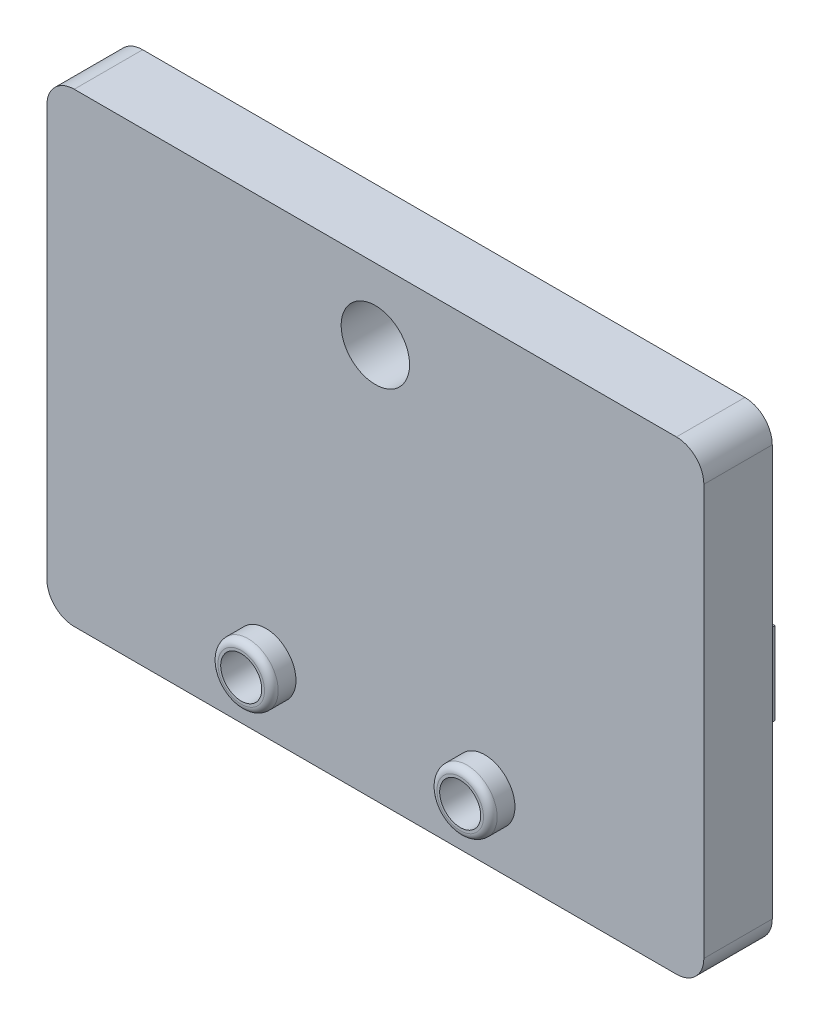
ISO-10303-21;
HEADER;
FILE_DESCRIPTION(('STEP AP214'),'2;1');
FILE_NAME('part.step','',(''),(''),'','','');
FILE_SCHEMA(('AUTOMOTIVE_DESIGN { 1 0 10303 214 1 1 1 1 }'));
ENDSEC;
DATA;
#1=APPLICATION_CONTEXT('core data for automotive mechanical design processes');
#2=APPLICATION_PROTOCOL_DEFINITION('international standard','automotive_design',2000,#1);
#3=PRODUCT_CONTEXT('',#1,'mechanical');
#4=PRODUCT('Part','Part','',(#3));
#5=PRODUCT_RELATED_PRODUCT_CATEGORY('part','',(#4));
#6=PRODUCT_DEFINITION_FORMATION('','',#4);
#7=PRODUCT_DEFINITION_CONTEXT('part definition',#1,'design');
#8=PRODUCT_DEFINITION('design','',#6,#7);
#9=PRODUCT_DEFINITION_SHAPE('','',#8);
#10=(LENGTH_UNIT() NAMED_UNIT(*) SI_UNIT(.MILLI.,.METRE.));
#11=(NAMED_UNIT(*) PLANE_ANGLE_UNIT() SI_UNIT($,.RADIAN.));
#12=(NAMED_UNIT(*) SI_UNIT($,.STERADIAN.) SOLID_ANGLE_UNIT());
#13=UNCERTAINTY_MEASURE_WITH_UNIT(LENGTH_MEASURE(1.E-05),#10,'distance_accuracy_value','');
#14=(GEOMETRIC_REPRESENTATION_CONTEXT(3) GLOBAL_UNCERTAINTY_ASSIGNED_CONTEXT((#13)) GLOBAL_UNIT_ASSIGNED_CONTEXT((#10,
#11,#12)) REPRESENTATION_CONTEXT('',''));
#15=CARTESIAN_POINT('',(0.,0.,0.));
#16=DIRECTION('',(0.,0.,1.));
#17=DIRECTION('',(1.,0.,0.));
#18=AXIS2_PLACEMENT_3D('',#15,#16,#17);
#19=CARTESIAN_POINT('',(10.4595722027057,87.8035788721695,0.));
#20=DIRECTION('',(0.,0.,1.));
#21=DIRECTION('',(1.,0.,0.));
#22=AXIS2_PLACEMENT_3D('',#19,#20,#21);
#23=PLANE('',#22);
#24=DIRECTION('',(0.,-1.,0.));
#25=VECTOR('',#24,1.);
#26=CARTESIAN_POINT('',(7.66930854298196,95.468963941608,0.));
#27=LINE('',#26,#25);
#28=CARTESIAN_POINT('',(7.66930854298196,101.468963941608,0.));
#29=VERTEX_POINT('',#28);
#30=CARTESIAN_POINT('',(7.66930854298196,95.468963941608,0.));
#31=VERTEX_POINT('',#30);
#32=EDGE_CURVE('E172',#29,#31,#27,.T.);
#33=ORIENTED_EDGE('',*,*,#32,.F.);
#34=DIRECTION('',(1.,0.,0.));
#35=VECTOR('',#34,1.);
#36=CARTESIAN_POINT('',(1.66930854298196,101.468963941608,0.));
#37=LINE('',#36,#35);
#38=CARTESIAN_POINT('',(1.66930854298196,101.468963941608,0.));
#39=VERTEX_POINT('',#38);
#40=EDGE_CURVE('E185',#39,#29,#37,.T.);
#41=ORIENTED_EDGE('',*,*,#40,.F.);
#42=DIRECTION('',(0.,1.,0.));
#43=VECTOR('',#42,1.);
#44=CARTESIAN_POINT('',(1.66930854298196,95.468963941608,0.));
#45=LINE('',#44,#43);
#46=CARTESIAN_POINT('',(1.66930854298196,95.468963941608,0.));
#47=VERTEX_POINT('',#46);
#48=EDGE_CURVE('E194',#47,#39,#45,.T.);
#49=ORIENTED_EDGE('',*,*,#48,.F.);
#50=DIRECTION('',(-1.,0.,0.));
#51=VECTOR('',#50,1.);
#52=CARTESIAN_POINT('',(1.66930854298196,95.468963941608,0.));
#53=LINE('',#52,#51);
#54=EDGE_CURVE('E175',#31,#47,#53,.T.);
#55=ORIENTED_EDGE('',*,*,#54,.F.);
#56=EDGE_LOOP('',(#33,#41,#49,#55));
#57=FACE_BOUND('',#56,.T.);
#58=CARTESIAN_POINT('',(-11.5404277972943,114.618963941608,0.));
#59=DIRECTION('',(0.,0.,-1.));
#60=DIRECTION('',(-1.,0.,0.));
#61=AXIS2_PLACEMENT_3D('',#58,#59,#60);
#62=CIRCLE('',#61,2.5);
#63=CARTESIAN_POINT('',(-14.0404277972943,114.618963941608,0.));
#64=VERTEX_POINT('',#63);
#65=EDGE_CURVE('E210',#64,#64,#62,.T.);
#66=ORIENTED_EDGE('',*,*,#65,.F.);
#67=EDGE_LOOP('',(#66));
#68=FACE_BOUND('',#67,.T.);
#69=CARTESIAN_POINT('',(-3.54042779729434,90.4912898586758,0.));
#70=DIRECTION('',(0.,0.,1.));
#71=DIRECTION('',(1.,0.,0.));
#72=AXIS2_PLACEMENT_3D('',#69,#70,#71);
#73=CIRCLE('',#72,1.5);
#74=CARTESIAN_POINT('',(-2.04042779729434,90.4912898586758,0.));
#75=VERTEX_POINT('',#74);
#76=EDGE_CURVE('E217',#75,#75,#73,.T.);
#77=ORIENTED_EDGE('',*,*,#76,.T.);
#78=EDGE_LOOP('',(#77));
#79=FACE_BOUND('',#78,.T.);
#80=CARTESIAN_POINT('',(-19.5404277972943,90.4912898586758,0.));
#81=DIRECTION('',(0.,0.,1.));
#82=DIRECTION('',(1.,0.,0.));
#83=AXIS2_PLACEMENT_3D('',#80,#81,#82);
#84=CIRCLE('',#83,1.5);
#85=CARTESIAN_POINT('',(-18.0404277972943,90.4912898586758,0.));
#86=VERTEX_POINT('',#85);
#87=EDGE_CURVE('E216',#86,#86,#84,.T.);
#88=ORIENTED_EDGE('',*,*,#87,.T.);
#89=EDGE_LOOP('',(#88));
#90=FACE_BOUND('',#89,.T.);
#91=CARTESIAN_POINT('',(10.4595722027057,87.8035788721695,0.));
#92=DIRECTION('',(0.,0.,1.));
#93=DIRECTION('',(1.,0.,0.));
#94=AXIS2_PLACEMENT_3D('',#91,#92,#93);
#95=CIRCLE('',#94,2.);
#96=CARTESIAN_POINT('',(10.4595722027057,85.8035788721695,0.));
#97=VERTEX_POINT('',#96);
#98=CARTESIAN_POINT('',(12.4595722027057,87.8035788721695,0.));
#99=VERTEX_POINT('',#98);
#100=EDGE_CURVE('E233',#97,#99,#95,.T.);
#101=ORIENTED_EDGE('',*,*,#100,.F.);
#102=DIRECTION('',(1.,0.,0.));
#103=VECTOR('',#102,1.);
#104=CARTESIAN_POINT('',(-33.5404277972944,85.8035788721695,0.));
#105=LINE('',#104,#103);
#106=CARTESIAN_POINT('',(-33.5404277972944,85.8035788721695,0.));
#107=VERTEX_POINT('',#106);
#108=EDGE_CURVE('E241',#107,#97,#105,.T.);
#109=ORIENTED_EDGE('',*,*,#108,.F.);
#110=CARTESIAN_POINT('',(-33.5404277972944,87.8035788721695,0.));
#111=DIRECTION('',(0.,0.,1.));
#112=DIRECTION('',(1.,0.,0.));
#113=AXIS2_PLACEMENT_3D('',#110,#111,#112);
#114=CIRCLE('',#113,2.);
#115=CARTESIAN_POINT('',(-35.5404277972944,87.8035788721695,0.));
#116=VERTEX_POINT('',#115);
#117=EDGE_CURVE('E268',#116,#107,#114,.T.);
#118=ORIENTED_EDGE('',*,*,#117,.F.);
#119=DIRECTION('',(0.,-1.,0.));
#120=VECTOR('',#119,1.);
#121=CARTESIAN_POINT('',(-35.5404277972944,117.80357887217,0.));
#122=LINE('',#121,#120);
#123=CARTESIAN_POINT('',(-35.5404277972944,117.80357887217,0.));
#124=VERTEX_POINT('',#123);
#125=EDGE_CURVE('E266',#124,#116,#122,.T.);
#126=ORIENTED_EDGE('',*,*,#125,.F.);
#127=CARTESIAN_POINT('',(-33.5404277972944,117.80357887217,0.));
#128=DIRECTION('',(0.,0.,1.));
#129=DIRECTION('',(1.,0.,0.));
#130=AXIS2_PLACEMENT_3D('',#127,#128,#129);
#131=CIRCLE('',#130,2.);
#132=CARTESIAN_POINT('',(-33.5404277972943,119.80357887217,0.));
#133=VERTEX_POINT('',#132);
#134=EDGE_CURVE('E264',#133,#124,#131,.T.);
#135=ORIENTED_EDGE('',*,*,#134,.F.);
#136=DIRECTION('',(-1.,0.,0.));
#137=VECTOR('',#136,1.);
#138=CARTESIAN_POINT('',(-33.5404277972943,119.80357887217,0.));
#139=LINE('',#138,#137);
#140=CARTESIAN_POINT('',(10.4595722027056,119.80357887217,0.));
#141=VERTEX_POINT('',#140);
#142=EDGE_CURVE('E262',#141,#133,#139,.T.);
#143=ORIENTED_EDGE('',*,*,#142,.F.);
#144=CARTESIAN_POINT('',(10.4595722027057,117.80357887217,0.));
#145=DIRECTION('',(0.,0.,1.));
#146=DIRECTION('',(-1.,0.,0.));
#147=AXIS2_PLACEMENT_3D('',#144,#145,#146);
#148=CIRCLE('',#147,2.);
#149=CARTESIAN_POINT('',(12.4595722027057,117.80357887217,0.));
#150=VERTEX_POINT('',#149);
#151=EDGE_CURVE('E260',#150,#141,#148,.T.);
#152=ORIENTED_EDGE('',*,*,#151,.F.);
#153=DIRECTION('',(0.,1.,0.));
#154=VECTOR('',#153,1.);
#155=CARTESIAN_POINT('',(12.4595722027057,117.80357887217,0.));
#156=LINE('',#155,#154);
#157=EDGE_CURVE('E258',#99,#150,#156,.T.);
#158=ORIENTED_EDGE('',*,*,#157,.F.);
#159=EDGE_LOOP('',(#101,#109,#118,#126,#135,#143,#152,#158));
#160=FACE_BOUND('',#159,.T.);
#161=DIRECTION('',(0.,-1.,0.));
#162=VECTOR('',#161,1.);
#163=CARTESIAN_POINT('',(-23.8923675022028,95.468963941608,0.));
#164=LINE('',#163,#162);
#165=CARTESIAN_POINT('',(-23.8923675022028,101.468963941608,0.));
#166=VERTEX_POINT('',#165);
#167=CARTESIAN_POINT('',(-23.8923675022028,95.468963941608,0.));
#168=VERTEX_POINT('',#167);
#169=EDGE_CURVE('E171',#166,#168,#164,.T.);
#170=ORIENTED_EDGE('',*,*,#169,.F.);
#171=DIRECTION('',(1.,0.,0.));
#172=VECTOR('',#171,1.);
#173=CARTESIAN_POINT('',(-29.8923675022028,101.468963941608,0.));
#174=LINE('',#173,#172);
#175=CARTESIAN_POINT('',(-29.8923675022028,101.468963941608,0.));
#176=VERTEX_POINT('',#175);
#177=EDGE_CURVE('E168',#176,#166,#174,.T.);
#178=ORIENTED_EDGE('',*,*,#177,.F.);
#179=DIRECTION('',(0.,1.,0.));
#180=VECTOR('',#179,1.);
#181=CARTESIAN_POINT('',(-29.8923675022028,95.468963941608,0.));
#182=LINE('',#181,#180);
#183=CARTESIAN_POINT('',(-29.8923675022028,95.468963941608,0.));
#184=VERTEX_POINT('',#183);
#185=EDGE_CURVE('E58',#184,#176,#182,.T.);
#186=ORIENTED_EDGE('',*,*,#185,.F.);
#187=DIRECTION('',(-1.,0.,0.));
#188=VECTOR('',#187,1.);
#189=CARTESIAN_POINT('',(-29.8923675022028,95.468963941608,0.));
#190=LINE('',#189,#188);
#191=EDGE_CURVE('E53',#168,#184,#190,.T.);
#192=ORIENTED_EDGE('',*,*,#191,.F.);
#193=EDGE_LOOP('',(#170,#178,#186,#192));
#194=FACE_BOUND('',#193,.T.);
#195=ADVANCED_FACE('F38',(#57,#68,#79,#90,#160,#194),#23,.F.);
#196=CARTESIAN_POINT('',(10.4595722027057,87.8035788721695,5.));
#197=DIRECTION('',(0.,0.,-1.));
#198=DIRECTION('',(-1.,0.,0.));
#199=AXIS2_PLACEMENT_3D('',#196,#197,#198);
#200=CYLINDRICAL_SURFACE('',#199,2.);
#201=ORIENTED_EDGE('',*,*,#100,.T.);
#202=DIRECTION('',(0.,0.,-1.));
#203=VECTOR('',#202,1.);
#204=CARTESIAN_POINT('',(12.4595722027057,87.8035788721695,5.));
#205=LINE('',#204,#203);
#206=CARTESIAN_POINT('',(12.4595722027057,87.8035788721695,5.));
#207=VERTEX_POINT('',#206);
#208=EDGE_CURVE('E236',#207,#99,#205,.T.);
#209=ORIENTED_EDGE('',*,*,#208,.F.);
#210=CARTESIAN_POINT('',(10.4595722027057,87.8035788721695,5.));
#211=DIRECTION('',(0.,0.,1.));
#212=DIRECTION('',(1.,0.,0.));
#213=AXIS2_PLACEMENT_3D('',#210,#211,#212);
#214=CIRCLE('',#213,2.);
#215=CARTESIAN_POINT('',(10.4595722027057,85.8035788721695,5.));
#216=VERTEX_POINT('',#215);
#217=EDGE_CURVE('E237',#216,#207,#214,.T.);
#218=ORIENTED_EDGE('',*,*,#217,.F.);
#219=DIRECTION('',(0.,0.,-1.));
#220=VECTOR('',#219,1.);
#221=CARTESIAN_POINT('',(10.4595722027057,85.8035788721695,5.));
#222=LINE('',#221,#220);
#223=EDGE_CURVE('E255',#216,#97,#222,.T.);
#224=ORIENTED_EDGE('',*,*,#223,.T.);
#225=EDGE_LOOP('',(#201,#209,#218,#224));
#226=FACE_BOUND('',#225,.T.);
#227=ADVANCED_FACE('F312',(#226),#200,.T.);
#228=CARTESIAN_POINT('',(12.4595722027057,117.80357887217,5.));
#229=DIRECTION('',(-1.,0.,0.));
#230=DIRECTION('',(0.,-1.,0.));
#231=AXIS2_PLACEMENT_3D('',#228,#229,#230);
#232=PLANE('',#231);
#233=ORIENTED_EDGE('',*,*,#157,.T.);
#234=DIRECTION('',(0.,0.,-1.));
#235=VECTOR('',#234,1.);
#236=CARTESIAN_POINT('',(12.4595722027057,117.80357887217,5.));
#237=LINE('',#236,#235);
#238=CARTESIAN_POINT('',(12.4595722027057,117.80357887217,5.));
#239=VERTEX_POINT('',#238);
#240=EDGE_CURVE('E288',#239,#150,#237,.T.);
#241=ORIENTED_EDGE('',*,*,#240,.F.);
#242=DIRECTION('',(0.,1.,0.));
#243=VECTOR('',#242,1.);
#244=CARTESIAN_POINT('',(12.4595722027057,117.80357887217,5.));
#245=LINE('',#244,#243);
#246=EDGE_CURVE('E240',#207,#239,#245,.T.);
#247=ORIENTED_EDGE('',*,*,#246,.F.);
#248=ORIENTED_EDGE('',*,*,#208,.T.);
#249=EDGE_LOOP('',(#233,#241,#247,#248));
#250=FACE_BOUND('',#249,.T.);
#251=ADVANCED_FACE('F318',(#250),#232,.F.);
#252=CARTESIAN_POINT('',(10.4595722027057,117.80357887217,5.));
#253=DIRECTION('',(0.,0.,-1.));
#254=DIRECTION('',(-1.,0.,0.));
#255=AXIS2_PLACEMENT_3D('',#252,#253,#254);
#256=CYLINDRICAL_SURFACE('',#255,2.);
#257=ORIENTED_EDGE('',*,*,#151,.T.);
#258=DIRECTION('',(0.,0.,-1.));
#259=VECTOR('',#258,1.);
#260=CARTESIAN_POINT('',(10.4595722027056,119.80357887217,5.));
#261=LINE('',#260,#259);
#262=CARTESIAN_POINT('',(10.4595722027056,119.80357887217,5.));
#263=VERTEX_POINT('',#262);
#264=EDGE_CURVE('E285',#263,#141,#261,.T.);
#265=ORIENTED_EDGE('',*,*,#264,.F.);
#266=CARTESIAN_POINT('',(10.4595722027057,117.80357887217,5.));
#267=DIRECTION('',(0.,0.,1.));
#268=DIRECTION('',(-1.,0.,0.));
#269=AXIS2_PLACEMENT_3D('',#266,#267,#268);
#270=CIRCLE('',#269,2.);
#271=EDGE_CURVE('E243',#239,#263,#270,.T.);
#272=ORIENTED_EDGE('',*,*,#271,.F.);
#273=ORIENTED_EDGE('',*,*,#240,.T.);
#274=EDGE_LOOP('',(#257,#265,#272,#273));
#275=FACE_BOUND('',#274,.T.);
#276=ADVANCED_FACE('F345',(#275),#256,.T.);
#277=CARTESIAN_POINT('',(-33.5404277972943,119.80357887217,5.));
#278=DIRECTION('',(0.,-1.,0.));
#279=DIRECTION('',(0.,0.,-1.));
#280=AXIS2_PLACEMENT_3D('',#277,#278,#279);
#281=PLANE('',#280);
#282=ORIENTED_EDGE('',*,*,#142,.T.);
#283=DIRECTION('',(0.,0.,-1.));
#284=VECTOR('',#283,1.);
#285=CARTESIAN_POINT('',(-33.5404277972943,119.80357887217,5.));
#286=LINE('',#285,#284);
#287=CARTESIAN_POINT('',(-33.5404277972943,119.80357887217,5.));
#288=VERTEX_POINT('',#287);
#289=EDGE_CURVE('E282',#288,#133,#286,.T.);
#290=ORIENTED_EDGE('',*,*,#289,.F.);
#291=DIRECTION('',(-1.,0.,0.));
#292=VECTOR('',#291,1.);
#293=CARTESIAN_POINT('',(-33.5404277972943,119.80357887217,5.));
#294=LINE('',#293,#292);
#295=EDGE_CURVE('E245',#263,#288,#294,.T.);
#296=ORIENTED_EDGE('',*,*,#295,.F.);
#297=ORIENTED_EDGE('',*,*,#264,.T.);
#298=EDGE_LOOP('',(#282,#290,#296,#297));
#299=FACE_BOUND('',#298,.T.);
#300=ADVANCED_FACE('F341',(#299),#281,.F.);
#301=CARTESIAN_POINT('',(-33.5404277972944,117.80357887217,5.));
#302=DIRECTION('',(0.,0.,-1.));
#303=DIRECTION('',(-1.,0.,0.));
#304=AXIS2_PLACEMENT_3D('',#301,#302,#303);
#305=CYLINDRICAL_SURFACE('',#304,2.);
#306=ORIENTED_EDGE('',*,*,#134,.T.);
#307=DIRECTION('',(0.,0.,-1.));
#308=VECTOR('',#307,1.);
#309=CARTESIAN_POINT('',(-35.5404277972944,117.80357887217,5.));
#310=LINE('',#309,#308);
#311=CARTESIAN_POINT('',(-35.5404277972944,117.80357887217,5.));
#312=VERTEX_POINT('',#311);
#313=EDGE_CURVE('E279',#312,#124,#310,.T.);
#314=ORIENTED_EDGE('',*,*,#313,.F.);
#315=CARTESIAN_POINT('',(-33.5404277972944,117.80357887217,5.));
#316=DIRECTION('',(0.,0.,1.));
#317=DIRECTION('',(1.,0.,0.));
#318=AXIS2_PLACEMENT_3D('',#315,#316,#317);
#319=CIRCLE('',#318,2.);
#320=EDGE_CURVE('E247',#288,#312,#319,.T.);
#321=ORIENTED_EDGE('',*,*,#320,.F.);
#322=ORIENTED_EDGE('',*,*,#289,.T.);
#323=EDGE_LOOP('',(#306,#314,#321,#322));
#324=FACE_BOUND('',#323,.T.);
#325=ADVANCED_FACE('F337',(#324),#305,.T.);
#326=CARTESIAN_POINT('',(-35.5404277972944,117.80357887217,5.));
#327=DIRECTION('',(1.,0.,0.));
#328=DIRECTION('',(0.,0.,-1.));
#329=AXIS2_PLACEMENT_3D('',#326,#327,#328);
#330=PLANE('',#329);
#331=ORIENTED_EDGE('',*,*,#125,.T.);
#332=DIRECTION('',(0.,0.,-1.));
#333=VECTOR('',#332,1.);
#334=CARTESIAN_POINT('',(-35.5404277972944,87.8035788721695,5.));
#335=LINE('',#334,#333);
#336=CARTESIAN_POINT('',(-35.5404277972944,87.8035788721695,5.));
#337=VERTEX_POINT('',#336);
#338=EDGE_CURVE('E276',#337,#116,#335,.T.);
#339=ORIENTED_EDGE('',*,*,#338,.F.);
#340=DIRECTION('',(0.,-1.,0.));
#341=VECTOR('',#340,1.);
#342=CARTESIAN_POINT('',(-35.5404277972944,117.80357887217,5.));
#343=LINE('',#342,#341);
#344=EDGE_CURVE('E249',#312,#337,#343,.T.);
#345=ORIENTED_EDGE('',*,*,#344,.F.);
#346=ORIENTED_EDGE('',*,*,#313,.T.);
#347=EDGE_LOOP('',(#331,#339,#345,#346));
#348=FACE_BOUND('',#347,.T.);
#349=ADVANCED_FACE('F333',(#348),#330,.F.);
#350=CARTESIAN_POINT('',(-33.5404277972944,87.8035788721695,5.));
#351=DIRECTION('',(0.,0.,-1.));
#352=DIRECTION('',(-1.,0.,0.));
#353=AXIS2_PLACEMENT_3D('',#350,#351,#352);
#354=CYLINDRICAL_SURFACE('',#353,2.);
#355=ORIENTED_EDGE('',*,*,#117,.T.);
#356=DIRECTION('',(0.,0.,-1.));
#357=VECTOR('',#356,1.);
#358=CARTESIAN_POINT('',(-33.5404277972944,85.8035788721695,5.));
#359=LINE('',#358,#357);
#360=CARTESIAN_POINT('',(-33.5404277972944,85.8035788721695,5.));
#361=VERTEX_POINT('',#360);
#362=EDGE_CURVE('E273',#361,#107,#359,.T.);
#363=ORIENTED_EDGE('',*,*,#362,.F.);
#364=CARTESIAN_POINT('',(-33.5404277972944,87.8035788721695,5.));
#365=DIRECTION('',(0.,0.,1.));
#366=DIRECTION('',(1.,0.,0.));
#367=AXIS2_PLACEMENT_3D('',#364,#365,#366);
#368=CIRCLE('',#367,2.);
#369=EDGE_CURVE('E251',#337,#361,#368,.T.);
#370=ORIENTED_EDGE('',*,*,#369,.F.);
#371=ORIENTED_EDGE('',*,*,#338,.T.);
#372=EDGE_LOOP('',(#355,#363,#370,#371));
#373=FACE_BOUND('',#372,.T.);
#374=ADVANCED_FACE('F329',(#373),#354,.T.);
#375=CARTESIAN_POINT('',(-33.5404277972944,85.8035788721695,5.));
#376=DIRECTION('',(0.,1.,0.));
#377=DIRECTION('',(0.,0.,1.));
#378=AXIS2_PLACEMENT_3D('',#375,#376,#377);
#379=PLANE('',#378);
#380=ORIENTED_EDGE('',*,*,#108,.T.);
#381=ORIENTED_EDGE('',*,*,#223,.F.);
#382=DIRECTION('',(1.,0.,0.));
#383=VECTOR('',#382,1.);
#384=CARTESIAN_POINT('',(-33.5404277972944,85.8035788721695,5.));
#385=LINE('',#384,#383);
#386=EDGE_CURVE('E253',#361,#216,#385,.T.);
#387=ORIENTED_EDGE('',*,*,#386,.F.);
#388=ORIENTED_EDGE('',*,*,#362,.T.);
#389=EDGE_LOOP('',(#380,#381,#387,#388));
#390=FACE_BOUND('',#389,.T.);
#391=ADVANCED_FACE('F326',(#390),#379,.F.);
#392=CARTESIAN_POINT('',(10.4595722027057,87.8035788721695,5.));
#393=DIRECTION('',(0.,0.,1.));
#394=DIRECTION('',(1.,0.,0.));
#395=AXIS2_PLACEMENT_3D('',#392,#393,#394);
#396=PLANE('',#395);
#397=CARTESIAN_POINT('',(-11.5404277972943,114.618963941608,5.));
#398=DIRECTION('',(0.,0.,1.));
#399=DIRECTION('',(1.,0.,0.));
#400=AXIS2_PLACEMENT_3D('',#397,#398,#399);
#401=CIRCLE('',#400,2.5);
#402=CARTESIAN_POINT('',(-9.04042779729435,114.618963941608,5.));
#403=VERTEX_POINT('',#402);
#404=EDGE_CURVE('E213',#403,#403,#401,.T.);
#405=ORIENTED_EDGE('',*,*,#404,.F.);
#406=EDGE_LOOP('',(#405));
#407=FACE_BOUND('',#406,.T.);
#408=CARTESIAN_POINT('',(-3.54042779729434,90.4912898586758,5.));
#409=DIRECTION('',(0.,0.,1.));
#410=DIRECTION('',(1.,0.,0.));
#411=AXIS2_PLACEMENT_3D('',#408,#409,#410);
#412=CIRCLE('',#411,2.2);
#413=CARTESIAN_POINT('',(-1.34042779729435,90.4912898586758,5.));
#414=VERTEX_POINT('',#413);
#415=EDGE_CURVE('E226',#414,#414,#412,.T.);
#416=ORIENTED_EDGE('',*,*,#415,.F.);
#417=EDGE_LOOP('',(#416));
#418=FACE_BOUND('',#417,.T.);
#419=CARTESIAN_POINT('',(-19.5404277972943,90.4912898586758,5.));
#420=DIRECTION('',(0.,0.,1.));
#421=DIRECTION('',(1.,0.,0.));
#422=AXIS2_PLACEMENT_3D('',#419,#420,#421);
#423=CIRCLE('',#422,2.2);
#424=CARTESIAN_POINT('',(-17.3404277972943,90.4912898586758,5.));
#425=VERTEX_POINT('',#424);
#426=EDGE_CURVE('E230',#425,#425,#423,.T.);
#427=ORIENTED_EDGE('',*,*,#426,.F.);
#428=EDGE_LOOP('',(#427));
#429=FACE_BOUND('',#428,.T.);
#430=ORIENTED_EDGE('',*,*,#217,.T.);
#431=ORIENTED_EDGE('',*,*,#246,.T.);
#432=ORIENTED_EDGE('',*,*,#271,.T.);
#433=ORIENTED_EDGE('',*,*,#295,.T.);
#434=ORIENTED_EDGE('',*,*,#320,.T.);
#435=ORIENTED_EDGE('',*,*,#344,.T.);
#436=ORIENTED_EDGE('',*,*,#369,.T.);
#437=ORIENTED_EDGE('',*,*,#386,.T.);
#438=EDGE_LOOP('',(#430,#431,#432,#433,#434,#435,#436,#437));
#439=FACE_BOUND('',#438,.T.);
#440=ADVANCED_FACE('F324',(#407,#418,#429,#439),#396,.T.);
#441=CARTESIAN_POINT('',(-19.5404277972943,90.4912898586758,0.));
#442=DIRECTION('',(0.,0.,1.));
#443=DIRECTION('',(1.,0.,0.));
#444=AXIS2_PLACEMENT_3D('',#441,#442,#443);
#445=CYLINDRICAL_SURFACE('',#444,2.2);
#446=CARTESIAN_POINT('',(-19.5404277972943,90.4912898586758,6.3));
#447=DIRECTION('',(0.,0.,1.));
#448=DIRECTION('',(1.,0.,0.));
#449=AXIS2_PLACEMENT_3D('',#446,#447,#448);
#450=CIRCLE('',#449,2.2);
#451=CARTESIAN_POINT('',(-17.3404277972943,90.4912898586758,6.3));
#452=VERTEX_POINT('',#451);
#453=EDGE_CURVE('E11',#452,#452,#450,.F.);
#454=ORIENTED_EDGE('',*,*,#453,.T.);
#455=EDGE_LOOP('',(#454));
#456=FACE_BOUND('',#455,.T.);
#457=ORIENTED_EDGE('',*,*,#426,.T.);
#458=EDGE_LOOP('',(#457));
#459=FACE_BOUND('',#458,.T.);
#460=ADVANCED_FACE('F379',(#456,#459),#445,.T.);
#461=CARTESIAN_POINT('',(-19.5404277972943,90.4912898586758,0.));
#462=DIRECTION('',(0.,0.,1.));
#463=DIRECTION('',(1.,0.,0.));
#464=AXIS2_PLACEMENT_3D('',#461,#462,#463);
#465=CYLINDRICAL_SURFACE('',#464,1.5);
#466=CARTESIAN_POINT('',(-19.5404277972943,90.4912898586758,6.8));
#467=DIRECTION('',(0.,0.,1.));
#468=DIRECTION('',(1.,0.,0.));
#469=AXIS2_PLACEMENT_3D('',#466,#467,#468);
#470=CIRCLE('',#469,1.5);
#471=CARTESIAN_POINT('',(-18.0404277972943,90.4912898586758,6.8));
#472=VERTEX_POINT('',#471);
#473=EDGE_CURVE('E225',#472,#472,#470,.T.);
#474=ORIENTED_EDGE('',*,*,#473,.T.);
#475=EDGE_LOOP('',(#474));
#476=FACE_BOUND('',#475,.T.);
#477=ORIENTED_EDGE('',*,*,#87,.F.);
#478=EDGE_LOOP('',(#477));
#479=FACE_BOUND('',#478,.T.);
#480=ADVANCED_FACE('F384',(#476,#479),#465,.F.);
#481=CARTESIAN_POINT('',(-19.5404277972943,90.4912898586758,6.8));
#482=DIRECTION('',(0.,0.,1.));
#483=DIRECTION('',(1.,0.,0.));
#484=AXIS2_PLACEMENT_3D('',#481,#482,#483);
#485=PLANE('',#484);
#486=CARTESIAN_POINT('',(-19.5404277972943,90.4912898586758,6.8));
#487=DIRECTION('',(0.,0.,1.));
#488=DIRECTION('',(1.,0.,0.));
#489=AXIS2_PLACEMENT_3D('',#486,#487,#488);
#490=CIRCLE('',#489,1.7);
#491=CARTESIAN_POINT('',(-17.8404277972943,90.4912898586758,6.8));
#492=VERTEX_POINT('',#491);
#493=EDGE_CURVE('E46',#492,#492,#490,.T.);
#494=ORIENTED_EDGE('',*,*,#493,.T.);
#495=EDGE_LOOP('',(#494));
#496=FACE_BOUND('',#495,.T.);
#497=ORIENTED_EDGE('',*,*,#473,.F.);
#498=EDGE_LOOP('',(#497));
#499=FACE_BOUND('',#498,.T.);
#500=ADVANCED_FACE('F300',(#496,#499),#485,.T.);
#501=CARTESIAN_POINT('',(-3.54042779729434,90.4912898586758,0.));
#502=DIRECTION('',(0.,0.,1.));
#503=DIRECTION('',(1.,0.,0.));
#504=AXIS2_PLACEMENT_3D('',#501,#502,#503);
#505=CYLINDRICAL_SURFACE('',#504,2.2);
#506=CARTESIAN_POINT('',(-3.54042779729434,90.4912898586758,6.3));
#507=DIRECTION('',(0.,0.,1.));
#508=DIRECTION('',(1.,0.,0.));
#509=AXIS2_PLACEMENT_3D('',#506,#507,#508);
#510=CIRCLE('',#509,2.2);
#511=CARTESIAN_POINT('',(-1.34042779729435,90.4912898586758,6.3));
#512=VERTEX_POINT('',#511);
#513=EDGE_CURVE('E295',#512,#512,#510,.F.);
#514=ORIENTED_EDGE('',*,*,#513,.T.);
#515=EDGE_LOOP('',(#514));
#516=FACE_BOUND('',#515,.T.);
#517=ORIENTED_EDGE('',*,*,#415,.T.);
#518=EDGE_LOOP('',(#517));
#519=FACE_BOUND('',#518,.T.);
#520=ADVANCED_FACE('F393',(#516,#519),#505,.T.);
#521=CARTESIAN_POINT('',(-3.54042779729434,90.4912898586758,0.));
#522=DIRECTION('',(0.,0.,1.));
#523=DIRECTION('',(1.,0.,0.));
#524=AXIS2_PLACEMENT_3D('',#521,#522,#523);
#525=CYLINDRICAL_SURFACE('',#524,1.5);
#526=CARTESIAN_POINT('',(-3.54042779729434,90.4912898586758,6.8));
#527=DIRECTION('',(0.,0.,1.));
#528=DIRECTION('',(1.,0.,0.));
#529=AXIS2_PLACEMENT_3D('',#526,#527,#528);
#530=CIRCLE('',#529,1.5);
#531=CARTESIAN_POINT('',(-2.04042779729434,90.4912898586758,6.8));
#532=VERTEX_POINT('',#531);
#533=EDGE_CURVE('E220',#532,#532,#530,.T.);
#534=ORIENTED_EDGE('',*,*,#533,.T.);
#535=EDGE_LOOP('',(#534));
#536=FACE_BOUND('',#535,.T.);
#537=ORIENTED_EDGE('',*,*,#76,.F.);
#538=EDGE_LOOP('',(#537));
#539=FACE_BOUND('',#538,.T.);
#540=ADVANCED_FACE('F395',(#536,#539),#525,.F.);
#541=CARTESIAN_POINT('',(-3.54042779729434,90.4912898586758,6.8));
#542=DIRECTION('',(0.,0.,1.));
#543=DIRECTION('',(1.,0.,0.));
#544=AXIS2_PLACEMENT_3D('',#541,#542,#543);
#545=PLANE('',#544);
#546=CARTESIAN_POINT('',(-3.54042779729434,90.4912898586758,6.8));
#547=DIRECTION('',(0.,0.,1.));
#548=DIRECTION('',(1.,0.,0.));
#549=AXIS2_PLACEMENT_3D('',#546,#547,#548);
#550=CIRCLE('',#549,1.7);
#551=CARTESIAN_POINT('',(-1.84042779729435,90.4912898586758,6.8));
#552=VERTEX_POINT('',#551);
#553=EDGE_CURVE('E229',#552,#552,#550,.T.);
#554=ORIENTED_EDGE('',*,*,#553,.T.);
#555=EDGE_LOOP('',(#554));
#556=FACE_BOUND('',#555,.T.);
#557=ORIENTED_EDGE('',*,*,#533,.F.);
#558=EDGE_LOOP('',(#557));
#559=FACE_BOUND('',#558,.T.);
#560=ADVANCED_FACE('F402',(#556,#559),#545,.T.);
#561=CARTESIAN_POINT('',(-11.5404277972943,114.618963941608,6.8));
#562=DIRECTION('',(0.,0.,-1.));
#563=DIRECTION('',(-1.,0.,0.));
#564=AXIS2_PLACEMENT_3D('',#561,#562,#563);
#565=CYLINDRICAL_SURFACE('',#564,2.5);
#566=ORIENTED_EDGE('',*,*,#404,.T.);
#567=EDGE_LOOP('',(#566));
#568=FACE_BOUND('',#567,.T.);
#569=ORIENTED_EDGE('',*,*,#65,.T.);
#570=EDGE_LOOP('',(#569));
#571=FACE_BOUND('',#570,.T.);
#572=ADVANCED_FACE('F442',(#568,#571),#565,.F.);
#573=CARTESIAN_POINT('',(7.66930854298196,95.468963941608,-5.));
#574=DIRECTION('',(-1.,0.,0.));
#575=DIRECTION('',(0.,0.,1.));
#576=AXIS2_PLACEMENT_3D('',#573,#574,#575);
#577=PLANE('',#576);
#578=ORIENTED_EDGE('',*,*,#32,.T.);
#579=DIRECTION('',(0.,0.,1.));
#580=VECTOR('',#579,1.);
#581=CARTESIAN_POINT('',(7.66930854298196,95.468963941608,-5.));
#582=LINE('',#581,#580);
#583=CARTESIAN_POINT('',(7.66930854298196,95.468963941608,-5.));
#584=VERTEX_POINT('',#583);
#585=EDGE_CURVE('E207',#584,#31,#582,.T.);
#586=ORIENTED_EDGE('',*,*,#585,.F.);
#587=DIRECTION('',(0.,-1.,0.));
#588=VECTOR('',#587,1.);
#589=CARTESIAN_POINT('',(7.66930854298196,95.468963941608,-5.));
#590=LINE('',#589,#588);
#591=CARTESIAN_POINT('',(7.66930854298196,101.468963941608,-5.));
#592=VERTEX_POINT('',#591);
#593=EDGE_CURVE('E181',#592,#584,#590,.T.);
#594=ORIENTED_EDGE('',*,*,#593,.F.);
#595=DIRECTION('',(0.,0.,1.));
#596=VECTOR('',#595,1.);
#597=CARTESIAN_POINT('',(7.66930854298196,101.468963941608,-5.));
#598=LINE('',#597,#596);
#599=EDGE_CURVE('E190',#592,#29,#598,.T.);
#600=ORIENTED_EDGE('',*,*,#599,.T.);
#601=EDGE_LOOP('',(#578,#586,#594,#600));
#602=FACE_BOUND('',#601,.T.);
#603=ADVANCED_FACE('F519',(#602),#577,.F.);
#604=CARTESIAN_POINT('',(1.66930854298196,95.468963941608,-5.));
#605=DIRECTION('',(0.,1.,0.));
#606=DIRECTION('',(0.,0.,1.));
#607=AXIS2_PLACEMENT_3D('',#604,#605,#606);
#608=PLANE('',#607);
#609=ORIENTED_EDGE('',*,*,#54,.T.);
#610=DIRECTION('',(0.,0.,1.));
#611=VECTOR('',#610,1.);
#612=CARTESIAN_POINT('',(1.66930854298196,95.468963941608,-5.));
#613=LINE('',#612,#611);
#614=CARTESIAN_POINT('',(1.66930854298196,95.468963941608,-5.));
#615=VERTEX_POINT('',#614);
#616=EDGE_CURVE('E204',#615,#47,#613,.T.);
#617=ORIENTED_EDGE('',*,*,#616,.F.);
#618=DIRECTION('',(-1.,0.,0.));
#619=VECTOR('',#618,1.);
#620=CARTESIAN_POINT('',(1.66930854298196,95.468963941608,-5.));
#621=LINE('',#620,#619);
#622=EDGE_CURVE('E184',#584,#615,#621,.T.);
#623=ORIENTED_EDGE('',*,*,#622,.F.);
#624=ORIENTED_EDGE('',*,*,#585,.T.);
#625=EDGE_LOOP('',(#609,#617,#623,#624));
#626=FACE_BOUND('',#625,.T.);
#627=ADVANCED_FACE('F511',(#626),#608,.F.);
#628=CARTESIAN_POINT('',(1.66930854298196,95.468963941608,-5.));
#629=DIRECTION('',(1.,0.,0.));
#630=DIRECTION('',(0.,0.,-1.));
#631=AXIS2_PLACEMENT_3D('',#628,#629,#630);
#632=PLANE('',#631);
#633=ORIENTED_EDGE('',*,*,#48,.T.);
#634=DIRECTION('',(0.,0.,1.));
#635=VECTOR('',#634,1.);
#636=CARTESIAN_POINT('',(1.66930854298196,101.468963941608,-5.));
#637=LINE('',#636,#635);
#638=CARTESIAN_POINT('',(1.66930854298196,101.468963941608,-5.));
#639=VERTEX_POINT('',#638);
#640=EDGE_CURVE('E201',#639,#39,#637,.T.);
#641=ORIENTED_EDGE('',*,*,#640,.F.);
#642=DIRECTION('',(0.,1.,0.));
#643=VECTOR('',#642,1.);
#644=CARTESIAN_POINT('',(1.66930854298196,95.468963941608,-5.));
#645=LINE('',#644,#643);
#646=EDGE_CURVE('E187',#615,#639,#645,.T.);
#647=ORIENTED_EDGE('',*,*,#646,.F.);
#648=ORIENTED_EDGE('',*,*,#616,.T.);
#649=EDGE_LOOP('',(#633,#641,#647,#648));
#650=FACE_BOUND('',#649,.T.);
#651=ADVANCED_FACE('F503',(#650),#632,.F.);
#652=CARTESIAN_POINT('',(1.66930854298196,101.468963941608,-5.));
#653=DIRECTION('',(0.,-1.,0.));
#654=DIRECTION('',(0.,0.,-1.));
#655=AXIS2_PLACEMENT_3D('',#652,#653,#654);
#656=PLANE('',#655);
#657=ORIENTED_EDGE('',*,*,#40,.T.);
#658=ORIENTED_EDGE('',*,*,#599,.F.);
#659=DIRECTION('',(1.,0.,0.));
#660=VECTOR('',#659,1.);
#661=CARTESIAN_POINT('',(1.66930854298196,101.468963941608,-5.));
#662=LINE('',#661,#660);
#663=EDGE_CURVE('E189',#639,#592,#662,.T.);
#664=ORIENTED_EDGE('',*,*,#663,.F.);
#665=ORIENTED_EDGE('',*,*,#640,.T.);
#666=EDGE_LOOP('',(#657,#658,#664,#665));
#667=FACE_BOUND('',#666,.T.);
#668=ADVANCED_FACE('F495',(#667),#656,.F.);
#669=CARTESIAN_POINT('',(0.,0.,-5.));
#670=DIRECTION('',(0.,0.,-1.));
#671=DIRECTION('',(-1.,0.,0.));
#672=AXIS2_PLACEMENT_3D('',#669,#670,#671);
#673=PLANE('',#672);
#674=ORIENTED_EDGE('',*,*,#593,.T.);
#675=ORIENTED_EDGE('',*,*,#622,.T.);
#676=ORIENTED_EDGE('',*,*,#646,.T.);
#677=ORIENTED_EDGE('',*,*,#663,.T.);
#678=EDGE_LOOP('',(#674,#675,#676,#677));
#679=FACE_BOUND('',#678,.T.);
#680=ADVANCED_FACE('F488',(#679),#673,.T.);
#681=CARTESIAN_POINT('',(-23.8923675022028,95.468963941608,-5.));
#682=DIRECTION('',(-1.,0.,0.));
#683=DIRECTION('',(0.,0.,1.));
#684=AXIS2_PLACEMENT_3D('',#681,#682,#683);
#685=PLANE('',#684);
#686=ORIENTED_EDGE('',*,*,#169,.T.);
#687=DIRECTION('',(0.,0.,1.));
#688=VECTOR('',#687,1.);
#689=CARTESIAN_POINT('',(-23.8923675022028,95.468963941608,-5.));
#690=LINE('',#689,#688);
#691=CARTESIAN_POINT('',(-23.8923675022028,95.468963941608,-5.));
#692=VERTEX_POINT('',#691);
#693=EDGE_CURVE('E152',#692,#168,#690,.T.);
#694=ORIENTED_EDGE('',*,*,#693,.F.);
#695=DIRECTION('',(0.,-1.,0.));
#696=VECTOR('',#695,1.);
#697=CARTESIAN_POINT('',(-23.8923675022028,95.468963941608,-5.));
#698=LINE('',#697,#696);
#699=CARTESIAN_POINT('',(-23.8923675022028,101.468963941608,-5.));
#700=VERTEX_POINT('',#699);
#701=EDGE_CURVE('E159',#700,#692,#698,.T.);
#702=ORIENTED_EDGE('',*,*,#701,.F.);
#703=DIRECTION('',(0.,0.,1.));
#704=VECTOR('',#703,1.);
#705=CARTESIAN_POINT('',(-23.8923675022028,101.468963941608,-5.));
#706=LINE('',#705,#704);
#707=EDGE_CURVE('E640',#700,#166,#706,.T.);
#708=ORIENTED_EDGE('',*,*,#707,.T.);
#709=EDGE_LOOP('',(#686,#694,#702,#708));
#710=FACE_BOUND('',#709,.T.);
#711=ADVANCED_FACE('F170',(#710),#685,.F.);
#712=CARTESIAN_POINT('',(-29.8923675022028,95.468963941608,-5.));
#713=DIRECTION('',(0.,1.,0.));
#714=DIRECTION('',(0.,0.,1.));
#715=AXIS2_PLACEMENT_3D('',#712,#713,#714);
#716=PLANE('',#715);
#717=ORIENTED_EDGE('',*,*,#191,.T.);
#718=DIRECTION('',(0.,0.,1.));
#719=VECTOR('',#718,1.);
#720=CARTESIAN_POINT('',(-29.8923675022028,95.468963941608,-5.));
#721=LINE('',#720,#719);
#722=CARTESIAN_POINT('',(-29.8923675022028,95.468963941608,-5.));
#723=VERTEX_POINT('',#722);
#724=EDGE_CURVE('E155',#723,#184,#721,.T.);
#725=ORIENTED_EDGE('',*,*,#724,.F.);
#726=DIRECTION('',(-1.,0.,0.));
#727=VECTOR('',#726,1.);
#728=CARTESIAN_POINT('',(-29.8923675022028,95.468963941608,-5.));
#729=LINE('',#728,#727);
#730=EDGE_CURVE('E148',#692,#723,#729,.T.);
#731=ORIENTED_EDGE('',*,*,#730,.F.);
#732=ORIENTED_EDGE('',*,*,#693,.T.);
#733=EDGE_LOOP('',(#717,#725,#731,#732));
#734=FACE_BOUND('',#733,.T.);
#735=ADVANCED_FACE('F150',(#734),#716,.F.);
#736=CARTESIAN_POINT('',(-29.8923675022028,95.468963941608,-5.));
#737=DIRECTION('',(1.,0.,0.));
#738=DIRECTION('',(0.,0.,-1.));
#739=AXIS2_PLACEMENT_3D('',#736,#737,#738);
#740=PLANE('',#739);
#741=ORIENTED_EDGE('',*,*,#185,.T.);
#742=DIRECTION('',(0.,0.,1.));
#743=VECTOR('',#742,1.);
#744=CARTESIAN_POINT('',(-29.8923675022028,101.468963941608,-5.));
#745=LINE('',#744,#743);
#746=CARTESIAN_POINT('',(-29.8923675022028,101.468963941608,-5.));
#747=VERTEX_POINT('',#746);
#748=EDGE_CURVE('E177',#747,#176,#745,.T.);
#749=ORIENTED_EDGE('',*,*,#748,.F.);
#750=DIRECTION('',(0.,1.,0.));
#751=VECTOR('',#750,1.);
#752=CARTESIAN_POINT('',(-29.8923675022028,95.468963941608,-5.));
#753=LINE('',#752,#751);
#754=EDGE_CURVE('E158',#723,#747,#753,.T.);
#755=ORIENTED_EDGE('',*,*,#754,.F.);
#756=ORIENTED_EDGE('',*,*,#724,.T.);
#757=EDGE_LOOP('',(#741,#749,#755,#756));
#758=FACE_BOUND('',#757,.T.);
#759=ADVANCED_FACE('F467',(#758),#740,.F.);
#760=CARTESIAN_POINT('',(-29.8923675022028,101.468963941608,-5.));
#761=DIRECTION('',(0.,-1.,0.));
#762=DIRECTION('',(0.,0.,-1.));
#763=AXIS2_PLACEMENT_3D('',#760,#761,#762);
#764=PLANE('',#763);
#765=ORIENTED_EDGE('',*,*,#177,.T.);
#766=ORIENTED_EDGE('',*,*,#707,.F.);
#767=DIRECTION('',(1.,0.,0.));
#768=VECTOR('',#767,1.);
#769=CARTESIAN_POINT('',(-29.8923675022028,101.468963941608,-5.));
#770=LINE('',#769,#768);
#771=EDGE_CURVE('E164',#747,#700,#770,.T.);
#772=ORIENTED_EDGE('',*,*,#771,.F.);
#773=ORIENTED_EDGE('',*,*,#748,.T.);
#774=EDGE_LOOP('',(#765,#766,#772,#773));
#775=FACE_BOUND('',#774,.T.);
#776=ADVANCED_FACE('F461',(#775),#764,.F.);
#777=CARTESIAN_POINT('',(0.,0.,-5.));
#778=DIRECTION('',(0.,0.,-1.));
#779=DIRECTION('',(-1.,0.,0.));
#780=AXIS2_PLACEMENT_3D('',#777,#778,#779);
#781=PLANE('',#780);
#782=ORIENTED_EDGE('',*,*,#701,.T.);
#783=ORIENTED_EDGE('',*,*,#730,.T.);
#784=ORIENTED_EDGE('',*,*,#754,.T.);
#785=ORIENTED_EDGE('',*,*,#771,.T.);
#786=EDGE_LOOP('',(#782,#783,#784,#785));
#787=FACE_BOUND('',#786,.T.);
#788=ADVANCED_FACE('F162',(#787),#781,.T.);
#789=CARTESIAN_POINT('',(-3.54042779729434,90.4912898586758,6.3));
#790=DIRECTION('',(0.,0.,1.));
#791=DIRECTION('',(1.,0.,0.));
#792=AXIS2_PLACEMENT_3D('',#789,#790,#791);
#793=TOROIDAL_SURFACE('',#792,1.7,0.5);
#794=ORIENTED_EDGE('',*,*,#513,.F.);
#795=EDGE_LOOP('',(#794));
#796=FACE_BOUND('',#795,.T.);
#797=ORIENTED_EDGE('',*,*,#553,.F.);
#798=EDGE_LOOP('',(#797));
#799=FACE_BOUND('',#798,.T.);
#800=ADVANCED_FACE('F304',(#796,#799),#793,.T.);
#801=CARTESIAN_POINT('',(-19.5404277972943,90.4912898586758,6.3));
#802=DIRECTION('',(0.,0.,1.));
#803=DIRECTION('',(1.,0.,0.));
#804=AXIS2_PLACEMENT_3D('',#801,#802,#803);
#805=TOROIDAL_SURFACE('',#804,1.7,0.5);
#806=ORIENTED_EDGE('',*,*,#453,.F.);
#807=EDGE_LOOP('',(#806));
#808=FACE_BOUND('',#807,.T.);
#809=ORIENTED_EDGE('',*,*,#493,.F.);
#810=EDGE_LOOP('',(#809));
#811=FACE_BOUND('',#810,.T.);
#812=ADVANCED_FACE('F40',(#808,#811),#805,.T.);
#813=CLOSED_SHELL('',(#195,#227,#251,#276,#300,#325,#349,#374,#391,#440,#460,#480,#500,#520,
#540,#560,#572,#603,#627,#651,#668,#680,#711,#735,#759,#776,#788,#800,#812));
#814=MANIFOLD_SOLID_BREP('B2',#813);
#815=ADVANCED_BREP_SHAPE_REPRESENTATION('',(#18,#814),#14);
#816=SHAPE_DEFINITION_REPRESENTATION(#9,#815);
ENDSEC;
END-ISO-10303-21;
